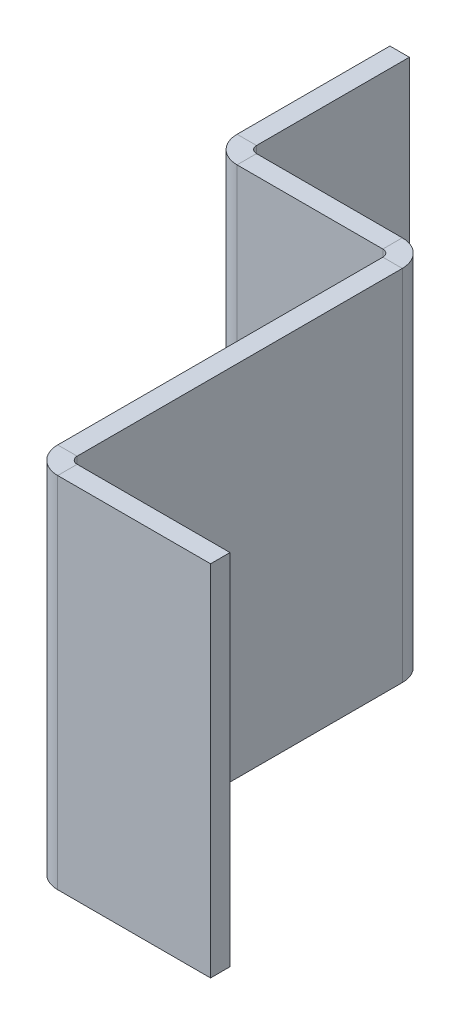
ISO-10303-21;
HEADER;
FILE_DESCRIPTION(('STEP AP214'),'2;1');
FILE_NAME('part.step','',(''),(''),'','','');
FILE_SCHEMA(('AUTOMOTIVE_DESIGN { 1 0 10303 214 1 1 1 1 }'));
ENDSEC;
DATA;
#1=APPLICATION_CONTEXT('core data for automotive mechanical design processes');
#2=APPLICATION_PROTOCOL_DEFINITION('international standard','automotive_design',2000,#1);
#3=PRODUCT_CONTEXT('',#1,'mechanical');
#4=PRODUCT('Part','Part','',(#3));
#5=PRODUCT_RELATED_PRODUCT_CATEGORY('part','',(#4));
#6=PRODUCT_DEFINITION_FORMATION('','',#4);
#7=PRODUCT_DEFINITION_CONTEXT('part definition',#1,'design');
#8=PRODUCT_DEFINITION('design','',#6,#7);
#9=PRODUCT_DEFINITION_SHAPE('','',#8);
#10=(LENGTH_UNIT() NAMED_UNIT(*) SI_UNIT(.MILLI.,.METRE.));
#11=(NAMED_UNIT(*) PLANE_ANGLE_UNIT() SI_UNIT($,.RADIAN.));
#12=(NAMED_UNIT(*) SI_UNIT($,.STERADIAN.) SOLID_ANGLE_UNIT());
#13=UNCERTAINTY_MEASURE_WITH_UNIT(LENGTH_MEASURE(1.E-05),#10,'distance_accuracy_value','');
#14=(GEOMETRIC_REPRESENTATION_CONTEXT(3) GLOBAL_UNCERTAINTY_ASSIGNED_CONTEXT((#13)) GLOBAL_UNIT_ASSIGNED_CONTEXT((#10,
#11,#12)) REPRESENTATION_CONTEXT('',''));
#15=CARTESIAN_POINT('',(0.,0.,0.));
#16=DIRECTION('',(0.,0.,1.));
#17=DIRECTION('',(1.,0.,0.));
#18=AXIS2_PLACEMENT_3D('',#15,#16,#17);
#19=CARTESIAN_POINT('',(15.45336,0.,22.64664));
#20=DIRECTION('',(0.,1.,0.));
#21=DIRECTION('',(0.,0.,-1.));
#22=AXIS2_PLACEMENT_3D('',#19,#20,#21);
#23=PLANE('',#22);
#24=DIRECTION('',(1.,0.,0.));
#25=VECTOR('',#24,1.);
#26=CARTESIAN_POINT('',(15.45336,0.,21.64664));
#27=LINE('',#26,#25);
#28=CARTESIAN_POINT('',(12.7,0.,21.64664));
#29=VERTEX_POINT('',#28);
#30=CARTESIAN_POINT('',(15.45336,0.,21.64664));
#31=VERTEX_POINT('',#30);
#32=EDGE_CURVE('E11',#29,#31,#27,.T.);
#33=ORIENTED_EDGE('',*,*,#32,.F.);
#34=DIRECTION('',(0.,0.,1.));
#35=VECTOR('',#34,1.);
#36=CARTESIAN_POINT('',(12.7,0.,22.64664));
#37=LINE('',#36,#35);
#38=CARTESIAN_POINT('',(12.7,0.,-24.4));
#39=VERTEX_POINT('',#38);
#40=EDGE_CURVE('E120',#29,#39,#37,.F.);
#41=ORIENTED_EDGE('',*,*,#40,.T.);
#42=DIRECTION('',(1.,0.,0.));
#43=VECTOR('',#42,1.);
#44=CARTESIAN_POINT('',(15.45336,0.,-24.4));
#45=LINE('',#44,#43);
#46=CARTESIAN_POINT('',(15.45336,0.,-24.4));
#47=VERTEX_POINT('',#46);
#48=EDGE_CURVE('E56',#39,#47,#45,.T.);
#49=ORIENTED_EDGE('',*,*,#48,.T.);
#50=DIRECTION('',(0.,0.,-1.));
#51=VECTOR('',#50,1.);
#52=CARTESIAN_POINT('',(15.45336,0.,22.64664));
#53=LINE('',#52,#51);
#54=EDGE_CURVE('E123',#31,#47,#53,.T.);
#55=ORIENTED_EDGE('',*,*,#54,.F.);
#56=EDGE_LOOP('',(#33,#41,#49,#55));
#57=FACE_BOUND('',#56,.T.);
#58=ADVANCED_FACE('F45',(#57),#23,.F.);
#59=CARTESIAN_POINT('',(11.7,0.,-24.4));
#60=DIRECTION('',(0.,1.,0.));
#61=DIRECTION('',(0.,0.,1.));
#62=AXIS2_PLACEMENT_3D('',#59,#60,#61);
#63=PLANE('',#62);
#64=ORIENTED_EDGE('',*,*,#48,.F.);
#65=CARTESIAN_POINT('',(11.7,0.,-24.4));
#66=DIRECTION('',(0.,-1.,0.));
#67=DIRECTION('',(0.,0.,-1.));
#68=AXIS2_PLACEMENT_3D('',#65,#66,#67);
#69=CIRCLE('',#68,1.);
#70=CARTESIAN_POINT('',(11.7,0.,-25.4));
#71=VERTEX_POINT('',#70);
#72=EDGE_CURVE('E167',#39,#71,#69,.F.);
#73=ORIENTED_EDGE('',*,*,#72,.T.);
#74=DIRECTION('',(0.,0.,-1.));
#75=VECTOR('',#74,1.);
#76=CARTESIAN_POINT('',(11.7,0.,-28.15336));
#77=LINE('',#76,#75);
#78=CARTESIAN_POINT('',(11.7,0.,-28.15336));
#79=VERTEX_POINT('',#78);
#80=EDGE_CURVE('E216',#71,#79,#77,.T.);
#81=ORIENTED_EDGE('',*,*,#80,.T.);
#82=CARTESIAN_POINT('',(11.7,0.,-24.4));
#83=DIRECTION('',(0.,-1.,0.));
#84=DIRECTION('',(0.,0.,-1.));
#85=AXIS2_PLACEMENT_3D('',#82,#83,#84);
#86=CIRCLE('',#85,3.75336);
#87=EDGE_CURVE('E241',#47,#79,#86,.F.);
#88=ORIENTED_EDGE('',*,*,#87,.F.);
#89=EDGE_LOOP('',(#64,#73,#81,#88));
#90=FACE_BOUND('',#89,.T.);
#91=ADVANCED_FACE('F242',(#90),#63,.F.);
#92=CARTESIAN_POINT('',(-9.94664,0.,-28.15336));
#93=DIRECTION('',(0.,1.,0.));
#94=DIRECTION('',(-1.,0.,0.));
#95=AXIS2_PLACEMENT_3D('',#92,#93,#94);
#96=PLANE('',#95);
#97=ORIENTED_EDGE('',*,*,#80,.F.);
#98=DIRECTION('',(1.,0.,0.));
#99=VECTOR('',#98,1.);
#100=CARTESIAN_POINT('',(-9.94664,0.,-25.4));
#101=LINE('',#100,#99);
#102=CARTESIAN_POINT('',(-8.94664,0.,-25.4));
#103=VERTEX_POINT('',#102);
#104=EDGE_CURVE('E164',#71,#103,#101,.F.);
#105=ORIENTED_EDGE('',*,*,#104,.T.);
#106=DIRECTION('',(0.,0.,-1.));
#107=VECTOR('',#106,1.);
#108=CARTESIAN_POINT('',(-8.94664,0.,-28.15336));
#109=LINE('',#108,#107);
#110=CARTESIAN_POINT('',(-8.94664,0.,-28.15336));
#111=VERTEX_POINT('',#110);
#112=EDGE_CURVE('E64',#103,#111,#109,.T.);
#113=ORIENTED_EDGE('',*,*,#112,.T.);
#114=DIRECTION('',(-1.,0.,0.));
#115=VECTOR('',#114,1.);
#116=CARTESIAN_POINT('',(-9.94664,0.,-28.15336));
#117=LINE('',#116,#115);
#118=EDGE_CURVE('E345',#79,#111,#117,.T.);
#119=ORIENTED_EDGE('',*,*,#118,.F.);
#120=EDGE_LOOP('',(#97,#105,#113,#119));
#121=FACE_BOUND('',#120,.T.);
#122=ADVANCED_FACE('F344',(#121),#96,.F.);
#123=CARTESIAN_POINT('',(-8.94664,0.,-29.15336));
#124=DIRECTION('',(0.,-1.,0.));
#125=DIRECTION('',(0.,0.,-1.));
#126=AXIS2_PLACEMENT_3D('',#123,#124,#125);
#127=PLANE('',#126);
#128=ORIENTED_EDGE('',*,*,#112,.F.);
#129=CARTESIAN_POINT('',(-8.94664,0.,-29.15336));
#130=DIRECTION('',(0.,1.,0.));
#131=DIRECTION('',(0.,0.,1.));
#132=AXIS2_PLACEMENT_3D('',#129,#130,#131);
#133=CIRCLE('',#132,3.75336);
#134=CARTESIAN_POINT('',(-12.7,0.,-29.15336));
#135=VERTEX_POINT('',#134);
#136=EDGE_CURVE('E318',#103,#135,#133,.F.);
#137=ORIENTED_EDGE('',*,*,#136,.T.);
#138=DIRECTION('',(1.,0.,0.));
#139=VECTOR('',#138,1.);
#140=CARTESIAN_POINT('',(-9.94664,0.,-29.15336));
#141=LINE('',#140,#139);
#142=CARTESIAN_POINT('',(-9.94664,0.,-29.15336));
#143=VERTEX_POINT('',#142);
#144=EDGE_CURVE('E210',#135,#143,#141,.T.);
#145=ORIENTED_EDGE('',*,*,#144,.T.);
#146=CARTESIAN_POINT('',(-8.94664,0.,-29.15336));
#147=DIRECTION('',(0.,1.,0.));
#148=DIRECTION('',(0.,0.,1.));
#149=AXIS2_PLACEMENT_3D('',#146,#147,#148);
#150=CIRCLE('',#149,1.);
#151=EDGE_CURVE('E274',#111,#143,#150,.F.);
#152=ORIENTED_EDGE('',*,*,#151,.F.);
#153=EDGE_LOOP('',(#128,#137,#145,#152));
#154=FACE_BOUND('',#153,.T.);
#155=ADVANCED_FACE('F473',(#154),#127,.T.);
#156=CARTESIAN_POINT('',(-9.94664,0.,-28.15336));
#157=DIRECTION('',(0.,1.,0.));
#158=DIRECTION('',(0.,0.,-1.));
#159=AXIS2_PLACEMENT_3D('',#156,#157,#158);
#160=PLANE('',#159);
#161=ORIENTED_EDGE('',*,*,#144,.F.);
#162=DIRECTION('',(0.,0.,1.));
#163=VECTOR('',#162,1.);
#164=CARTESIAN_POINT('',(-12.7,0.,-28.15336));
#165=LINE('',#164,#163);
#166=CARTESIAN_POINT('',(-12.7,0.,-50.8));
#167=VERTEX_POINT('',#166);
#168=EDGE_CURVE('E309',#135,#167,#165,.F.);
#169=ORIENTED_EDGE('',*,*,#168,.T.);
#170=DIRECTION('',(1.,0.,0.));
#171=VECTOR('',#170,1.);
#172=CARTESIAN_POINT('',(-9.94664,0.,-50.8));
#173=LINE('',#172,#171);
#174=CARTESIAN_POINT('',(-9.94664,0.,-50.8));
#175=VERTEX_POINT('',#174);
#176=EDGE_CURVE('E206',#167,#175,#173,.T.);
#177=ORIENTED_EDGE('',*,*,#176,.T.);
#178=DIRECTION('',(0.,0.,-1.));
#179=VECTOR('',#178,1.);
#180=CARTESIAN_POINT('',(-9.94664,0.,-28.15336));
#181=LINE('',#180,#179);
#182=EDGE_CURVE('E389',#143,#175,#181,.T.);
#183=ORIENTED_EDGE('',*,*,#182,.F.);
#184=EDGE_LOOP('',(#161,#169,#177,#183));
#185=FACE_BOUND('',#184,.T.);
#186=ADVANCED_FACE('F390',(#185),#160,.F.);
#187=CARTESIAN_POINT('',(-9.94664,50.8,-50.8));
#188=DIRECTION('',(0.,0.,-1.));
#189=DIRECTION('',(0.,-1.,0.));
#190=AXIS2_PLACEMENT_3D('',#187,#188,#189);
#191=PLANE('',#190);
#192=ORIENTED_EDGE('',*,*,#176,.F.);
#193=DIRECTION('',(0.,1.,0.));
#194=VECTOR('',#193,1.);
#195=CARTESIAN_POINT('',(-12.7,50.8,-50.8));
#196=LINE('',#195,#194);
#197=CARTESIAN_POINT('',(-12.7,50.8,-50.8));
#198=VERTEX_POINT('',#197);
#199=EDGE_CURVE('E322',#198,#167,#196,.F.);
#200=ORIENTED_EDGE('',*,*,#199,.F.);
#201=DIRECTION('',(1.,0.,0.));
#202=VECTOR('',#201,1.);
#203=CARTESIAN_POINT('',(-9.94664,50.8,-50.8));
#204=LINE('',#203,#202);
#205=CARTESIAN_POINT('',(-9.94664,50.8,-50.8));
#206=VERTEX_POINT('',#205);
#207=EDGE_CURVE('E202',#198,#206,#204,.T.);
#208=ORIENTED_EDGE('',*,*,#207,.T.);
#209=DIRECTION('',(0.,-1.,0.));
#210=VECTOR('',#209,1.);
#211=CARTESIAN_POINT('',(-9.94664,50.8,-50.8));
#212=LINE('',#211,#210);
#213=EDGE_CURVE('E378',#206,#175,#212,.T.);
#214=ORIENTED_EDGE('',*,*,#213,.T.);
#215=EDGE_LOOP('',(#192,#200,#208,#214));
#216=FACE_BOUND('',#215,.T.);
#217=ADVANCED_FACE('F444',(#216),#191,.T.);
#218=CARTESIAN_POINT('',(-9.94664,50.8,-28.15336));
#219=DIRECTION('',(0.,1.,0.));
#220=DIRECTION('',(0.,0.,-1.));
#221=AXIS2_PLACEMENT_3D('',#218,#219,#220);
#222=PLANE('',#221);
#223=ORIENTED_EDGE('',*,*,#207,.F.);
#224=DIRECTION('',(0.,0.,1.));
#225=VECTOR('',#224,1.);
#226=CARTESIAN_POINT('',(-12.7,50.8,-28.15336));
#227=LINE('',#226,#225);
#228=CARTESIAN_POINT('',(-12.7,50.8,-29.15336));
#229=VERTEX_POINT('',#228);
#230=EDGE_CURVE('E301',#229,#198,#227,.F.);
#231=ORIENTED_EDGE('',*,*,#230,.F.);
#232=DIRECTION('',(1.,0.,0.));
#233=VECTOR('',#232,1.);
#234=CARTESIAN_POINT('',(-9.94664,50.8,-29.15336));
#235=LINE('',#234,#233);
#236=CARTESIAN_POINT('',(-9.94664,50.8,-29.15336));
#237=VERTEX_POINT('',#236);
#238=EDGE_CURVE('E198',#229,#237,#235,.T.);
#239=ORIENTED_EDGE('',*,*,#238,.T.);
#240=DIRECTION('',(0.,0.,-1.));
#241=VECTOR('',#240,1.);
#242=CARTESIAN_POINT('',(-9.94664,50.8,-28.15336));
#243=LINE('',#242,#241);
#244=EDGE_CURVE('E368',#237,#206,#243,.T.);
#245=ORIENTED_EDGE('',*,*,#244,.T.);
#246=EDGE_LOOP('',(#223,#231,#239,#245));
#247=FACE_BOUND('',#246,.T.);
#248=ADVANCED_FACE('F366',(#247),#222,.T.);
#249=CARTESIAN_POINT('',(-8.94664,50.8,-29.15336));
#250=DIRECTION('',(0.,1.,0.));
#251=DIRECTION('',(0.,0.,1.));
#252=AXIS2_PLACEMENT_3D('',#249,#250,#251);
#253=PLANE('',#252);
#254=ORIENTED_EDGE('',*,*,#238,.F.);
#255=CARTESIAN_POINT('',(-8.94664,50.8,-29.15336));
#256=DIRECTION('',(0.,1.,0.));
#257=DIRECTION('',(0.,0.,1.));
#258=AXIS2_PLACEMENT_3D('',#255,#256,#257);
#259=CIRCLE('',#258,3.75336);
#260=CARTESIAN_POINT('',(-8.94664,50.8,-25.4));
#261=VERTEX_POINT('',#260);
#262=EDGE_CURVE('E314',#229,#261,#259,.T.);
#263=ORIENTED_EDGE('',*,*,#262,.T.);
#264=DIRECTION('',(0.,0.,-1.));
#265=VECTOR('',#264,1.);
#266=CARTESIAN_POINT('',(-8.94664,50.8,-28.15336));
#267=LINE('',#266,#265);
#268=CARTESIAN_POINT('',(-8.94664,50.8,-28.15336));
#269=VERTEX_POINT('',#268);
#270=EDGE_CURVE('E195',#261,#269,#267,.T.);
#271=ORIENTED_EDGE('',*,*,#270,.T.);
#272=CARTESIAN_POINT('',(-8.94664,50.8,-29.15336));
#273=DIRECTION('',(0.,-1.,0.));
#274=DIRECTION('',(0.,0.,-1.));
#275=AXIS2_PLACEMENT_3D('',#272,#273,#274);
#276=CIRCLE('',#275,1.);
#277=EDGE_CURVE('E248',#237,#269,#276,.F.);
#278=ORIENTED_EDGE('',*,*,#277,.F.);
#279=EDGE_LOOP('',(#254,#263,#271,#278));
#280=FACE_BOUND('',#279,.T.);
#281=ADVANCED_FACE('F382',(#280),#253,.T.);
#282=CARTESIAN_POINT('',(-9.94664,50.8,-28.15336));
#283=DIRECTION('',(0.,1.,0.));
#284=DIRECTION('',(-1.,0.,0.));
#285=AXIS2_PLACEMENT_3D('',#282,#283,#284);
#286=PLANE('',#285);
#287=ORIENTED_EDGE('',*,*,#270,.F.);
#288=DIRECTION('',(1.,0.,0.));
#289=VECTOR('',#288,1.);
#290=CARTESIAN_POINT('',(-9.94664,50.8,-25.4));
#291=LINE('',#290,#289);
#292=CARTESIAN_POINT('',(11.7,50.8,-25.4));
#293=VERTEX_POINT('',#292);
#294=EDGE_CURVE('E154',#293,#261,#291,.F.);
#295=ORIENTED_EDGE('',*,*,#294,.F.);
#296=DIRECTION('',(0.,0.,-1.));
#297=VECTOR('',#296,1.);
#298=CARTESIAN_POINT('',(11.7,50.8,-28.15336));
#299=LINE('',#298,#297);
#300=CARTESIAN_POINT('',(11.7,50.8,-28.15336));
#301=VERTEX_POINT('',#300);
#302=EDGE_CURVE('E191',#293,#301,#299,.T.);
#303=ORIENTED_EDGE('',*,*,#302,.T.);
#304=DIRECTION('',(-1.,0.,0.));
#305=VECTOR('',#304,1.);
#306=CARTESIAN_POINT('',(-9.94664,50.8,-28.15336));
#307=LINE('',#306,#305);
#308=EDGE_CURVE('E238',#301,#269,#307,.T.);
#309=ORIENTED_EDGE('',*,*,#308,.T.);
#310=EDGE_LOOP('',(#287,#295,#303,#309));
#311=FACE_BOUND('',#310,.T.);
#312=ADVANCED_FACE('F451',(#311),#286,.T.);
#313=CARTESIAN_POINT('',(11.7,50.8,-24.4));
#314=DIRECTION('',(0.,-1.,0.));
#315=DIRECTION('',(0.,0.,-1.));
#316=AXIS2_PLACEMENT_3D('',#313,#314,#315);
#317=PLANE('',#316);
#318=ORIENTED_EDGE('',*,*,#302,.F.);
#319=CARTESIAN_POINT('',(11.7,50.8,-24.4));
#320=DIRECTION('',(0.,-1.,0.));
#321=DIRECTION('',(0.,0.,-1.));
#322=AXIS2_PLACEMENT_3D('',#319,#320,#321);
#323=CIRCLE('',#322,1.);
#324=CARTESIAN_POINT('',(12.7,50.8,-24.4));
#325=VERTEX_POINT('',#324);
#326=EDGE_CURVE('E160',#293,#325,#323,.T.);
#327=ORIENTED_EDGE('',*,*,#326,.T.);
#328=DIRECTION('',(1.,0.,0.));
#329=VECTOR('',#328,1.);
#330=CARTESIAN_POINT('',(15.45336,50.8,-24.4));
#331=LINE('',#330,#329);
#332=CARTESIAN_POINT('',(15.45336,50.8,-24.4));
#333=VERTEX_POINT('',#332);
#334=EDGE_CURVE('E187',#325,#333,#331,.T.);
#335=ORIENTED_EDGE('',*,*,#334,.T.);
#336=CARTESIAN_POINT('',(11.7,50.8,-24.4));
#337=DIRECTION('',(0.,1.,0.));
#338=DIRECTION('',(0.,0.,1.));
#339=AXIS2_PLACEMENT_3D('',#336,#337,#338);
#340=CIRCLE('',#339,3.75336);
#341=EDGE_CURVE('E247',#301,#333,#340,.F.);
#342=ORIENTED_EDGE('',*,*,#341,.F.);
#343=EDGE_LOOP('',(#318,#327,#335,#342));
#344=FACE_BOUND('',#343,.T.);
#345=ADVANCED_FACE('F455',(#344),#317,.F.);
#346=CARTESIAN_POINT('',(15.45336,50.8,22.64664));
#347=DIRECTION('',(0.,1.,0.));
#348=DIRECTION('',(0.,0.,-1.));
#349=AXIS2_PLACEMENT_3D('',#346,#347,#348);
#350=PLANE('',#349);
#351=ORIENTED_EDGE('',*,*,#334,.F.);
#352=DIRECTION('',(0.,0.,1.));
#353=VECTOR('',#352,1.);
#354=CARTESIAN_POINT('',(12.7,50.8,22.64664));
#355=LINE('',#354,#353);
#356=CARTESIAN_POINT('',(12.7,50.8,21.64664));
#357=VERTEX_POINT('',#356);
#358=EDGE_CURVE('E153',#357,#325,#355,.F.);
#359=ORIENTED_EDGE('',*,*,#358,.F.);
#360=DIRECTION('',(1.,0.,0.));
#361=VECTOR('',#360,1.);
#362=CARTESIAN_POINT('',(15.45336,50.8,21.64664));
#363=LINE('',#362,#361);
#364=CARTESIAN_POINT('',(15.45336,50.8,21.64664));
#365=VERTEX_POINT('',#364);
#366=EDGE_CURVE('E183',#357,#365,#363,.T.);
#367=ORIENTED_EDGE('',*,*,#366,.T.);
#368=DIRECTION('',(0.,0.,-1.));
#369=VECTOR('',#368,1.);
#370=CARTESIAN_POINT('',(15.45336,50.8,22.64664));
#371=LINE('',#370,#369);
#372=EDGE_CURVE('E237',#365,#333,#371,.T.);
#373=ORIENTED_EDGE('',*,*,#372,.T.);
#374=EDGE_LOOP('',(#351,#359,#367,#373));
#375=FACE_BOUND('',#374,.T.);
#376=ADVANCED_FACE('F461',(#375),#350,.T.);
#377=CARTESIAN_POINT('',(16.45336,50.8,21.64664));
#378=DIRECTION('',(0.,1.,0.));
#379=DIRECTION('',(0.,0.,1.));
#380=AXIS2_PLACEMENT_3D('',#377,#378,#379);
#381=PLANE('',#380);
#382=ORIENTED_EDGE('',*,*,#366,.F.);
#383=CARTESIAN_POINT('',(16.45336,50.8,21.64664));
#384=DIRECTION('',(0.,1.,0.));
#385=DIRECTION('',(0.,0.,1.));
#386=AXIS2_PLACEMENT_3D('',#383,#384,#385);
#387=CIRCLE('',#386,3.75336);
#388=CARTESIAN_POINT('',(16.45336,50.8,25.4));
#389=VERTEX_POINT('',#388);
#390=EDGE_CURVE('E139',#357,#389,#387,.T.);
#391=ORIENTED_EDGE('',*,*,#390,.T.);
#392=DIRECTION('',(0.,0.,-1.));
#393=VECTOR('',#392,1.);
#394=CARTESIAN_POINT('',(16.45336,50.8,22.64664));
#395=LINE('',#394,#393);
#396=CARTESIAN_POINT('',(16.45336,50.8,22.64664));
#397=VERTEX_POINT('',#396);
#398=EDGE_CURVE('E179',#389,#397,#395,.T.);
#399=ORIENTED_EDGE('',*,*,#398,.T.);
#400=CARTESIAN_POINT('',(16.45336,50.8,21.64664));
#401=DIRECTION('',(0.,-1.,0.));
#402=DIRECTION('',(0.,0.,-1.));
#403=AXIS2_PLACEMENT_3D('',#400,#401,#402);
#404=CIRCLE('',#403,1.);
#405=EDGE_CURVE('E352',#365,#397,#404,.F.);
#406=ORIENTED_EDGE('',*,*,#405,.F.);
#407=EDGE_LOOP('',(#382,#391,#399,#406));
#408=FACE_BOUND('',#407,.T.);
#409=ADVANCED_FACE('F511',(#408),#381,.T.);
#410=CARTESIAN_POINT('',(15.45336,50.8,22.64664));
#411=DIRECTION('',(0.,1.,0.));
#412=DIRECTION('',(-1.,0.,0.));
#413=AXIS2_PLACEMENT_3D('',#410,#411,#412);
#414=PLANE('',#413);
#415=ORIENTED_EDGE('',*,*,#398,.F.);
#416=DIRECTION('',(1.,0.,0.));
#417=VECTOR('',#416,1.);
#418=CARTESIAN_POINT('',(15.45336,50.8,25.4));
#419=LINE('',#418,#417);
#420=CARTESIAN_POINT('',(38.1,50.8,25.4));
#421=VERTEX_POINT('',#420);
#422=EDGE_CURVE('E300',#421,#389,#419,.F.);
#423=ORIENTED_EDGE('',*,*,#422,.F.);
#424=DIRECTION('',(0.,0.,-1.));
#425=VECTOR('',#424,1.);
#426=CARTESIAN_POINT('',(38.1,50.8,22.64664));
#427=LINE('',#426,#425);
#428=CARTESIAN_POINT('',(38.1,50.8,22.64664));
#429=VERTEX_POINT('',#428);
#430=EDGE_CURVE('E175',#421,#429,#427,.T.);
#431=ORIENTED_EDGE('',*,*,#430,.T.);
#432=DIRECTION('',(-1.,0.,0.));
#433=VECTOR('',#432,1.);
#434=CARTESIAN_POINT('',(15.45336,50.8,22.64664));
#435=LINE('',#434,#433);
#436=EDGE_CURVE('E401',#429,#397,#435,.T.);
#437=ORIENTED_EDGE('',*,*,#436,.T.);
#438=EDGE_LOOP('',(#415,#423,#431,#437));
#439=FACE_BOUND('',#438,.T.);
#440=ADVANCED_FACE('F426',(#439),#414,.T.);
#441=CARTESIAN_POINT('',(38.1,50.8,22.64664));
#442=DIRECTION('',(-1.,0.,0.));
#443=DIRECTION('',(0.,-1.,0.));
#444=AXIS2_PLACEMENT_3D('',#441,#442,#443);
#445=PLANE('',#444);
#446=ORIENTED_EDGE('',*,*,#430,.F.);
#447=DIRECTION('',(0.,1.,0.));
#448=VECTOR('',#447,1.);
#449=CARTESIAN_POINT('',(38.1,50.8,25.4));
#450=LINE('',#449,#448);
#451=CARTESIAN_POINT('',(38.1,0.,25.4));
#452=VERTEX_POINT('',#451);
#453=EDGE_CURVE('E145',#421,#452,#450,.F.);
#454=ORIENTED_EDGE('',*,*,#453,.T.);
#455=DIRECTION('',(0.,0.,-1.));
#456=VECTOR('',#455,1.);
#457=CARTESIAN_POINT('',(38.1,0.,22.64664));
#458=LINE('',#457,#456);
#459=CARTESIAN_POINT('',(38.1,0.,22.64664));
#460=VERTEX_POINT('',#459);
#461=EDGE_CURVE('E171',#452,#460,#458,.T.);
#462=ORIENTED_EDGE('',*,*,#461,.T.);
#463=DIRECTION('',(0.,-1.,0.));
#464=VECTOR('',#463,1.);
#465=CARTESIAN_POINT('',(38.1,50.8,22.64664));
#466=LINE('',#465,#464);
#467=EDGE_CURVE('E405',#429,#460,#466,.T.);
#468=ORIENTED_EDGE('',*,*,#467,.F.);
#469=EDGE_LOOP('',(#446,#454,#462,#468));
#470=FACE_BOUND('',#469,.T.);
#471=ADVANCED_FACE('F531',(#470),#445,.F.);
#472=CARTESIAN_POINT('',(15.45336,0.,22.64664));
#473=DIRECTION('',(0.,1.,0.));
#474=DIRECTION('',(-1.,0.,0.));
#475=AXIS2_PLACEMENT_3D('',#472,#473,#474);
#476=PLANE('',#475);
#477=ORIENTED_EDGE('',*,*,#461,.F.);
#478=DIRECTION('',(1.,0.,0.));
#479=VECTOR('',#478,1.);
#480=CARTESIAN_POINT('',(15.45336,0.,25.4));
#481=LINE('',#480,#479);
#482=CARTESIAN_POINT('',(16.45336,0.,25.4));
#483=VERTEX_POINT('',#482);
#484=EDGE_CURVE('E297',#452,#483,#481,.F.);
#485=ORIENTED_EDGE('',*,*,#484,.T.);
#486=DIRECTION('',(0.,0.,-1.));
#487=VECTOR('',#486,1.);
#488=CARTESIAN_POINT('',(16.45336,0.,22.64664));
#489=LINE('',#488,#487);
#490=CARTESIAN_POINT('',(16.45336,0.,22.64664));
#491=VERTEX_POINT('',#490);
#492=EDGE_CURVE('E49',#483,#491,#489,.T.);
#493=ORIENTED_EDGE('',*,*,#492,.T.);
#494=DIRECTION('',(-1.,0.,0.));
#495=VECTOR('',#494,1.);
#496=CARTESIAN_POINT('',(15.45336,0.,22.64664));
#497=LINE('',#496,#495);
#498=EDGE_CURVE('E380',#460,#491,#497,.T.);
#499=ORIENTED_EDGE('',*,*,#498,.F.);
#500=EDGE_LOOP('',(#477,#485,#493,#499));
#501=FACE_BOUND('',#500,.T.);
#502=ADVANCED_FACE('F541',(#501),#476,.F.);
#503=CARTESIAN_POINT('',(16.45336,0.,21.64664));
#504=DIRECTION('',(0.,-1.,0.));
#505=DIRECTION('',(0.,0.,-1.));
#506=AXIS2_PLACEMENT_3D('',#503,#504,#505);
#507=PLANE('',#506);
#508=CARTESIAN_POINT('',(16.45336,0.,21.64664));
#509=DIRECTION('',(0.,1.,0.));
#510=DIRECTION('',(0.,0.,1.));
#511=AXIS2_PLACEMENT_3D('',#508,#509,#510);
#512=CIRCLE('',#511,3.75336);
#513=EDGE_CURVE('E136',#483,#29,#512,.F.);
#514=ORIENTED_EDGE('',*,*,#513,.T.);
#515=ORIENTED_EDGE('',*,*,#32,.T.);
#516=CARTESIAN_POINT('',(16.45336,0.,21.64664));
#517=DIRECTION('',(0.,1.,0.));
#518=DIRECTION('',(0.,0.,1.));
#519=AXIS2_PLACEMENT_3D('',#516,#517,#518);
#520=CIRCLE('',#519,1.);
#521=EDGE_CURVE('E269',#491,#31,#520,.F.);
#522=ORIENTED_EDGE('',*,*,#521,.F.);
#523=ORIENTED_EDGE('',*,*,#492,.F.);
#524=EDGE_LOOP('',(#514,#515,#522,#523));
#525=FACE_BOUND('',#524,.T.);
#526=ADVANCED_FACE('F47',(#525),#507,.T.);
#527=CARTESIAN_POINT('',(15.45336,50.8,22.64664));
#528=DIRECTION('',(0.,0.,1.));
#529=DIRECTION('',(1.,0.,0.));
#530=AXIS2_PLACEMENT_3D('',#527,#528,#529);
#531=PLANE('',#530);
#532=ORIENTED_EDGE('',*,*,#498,.T.);
#533=DIRECTION('',(0.,-1.,0.));
#534=VECTOR('',#533,1.);
#535=CARTESIAN_POINT('',(16.45336,50.8,22.64664));
#536=LINE('',#535,#534);
#537=EDGE_CURVE('E264',#491,#397,#536,.F.);
#538=ORIENTED_EDGE('',*,*,#537,.T.);
#539=ORIENTED_EDGE('',*,*,#436,.F.);
#540=ORIENTED_EDGE('',*,*,#467,.T.);
#541=EDGE_LOOP('',(#532,#538,#539,#540));
#542=FACE_BOUND('',#541,.T.);
#543=ADVANCED_FACE('F431',(#542),#531,.F.);
#544=CARTESIAN_POINT('',(-9.94664,50.8,-28.15336));
#545=DIRECTION('',(-1.,0.,0.));
#546=DIRECTION('',(0.,0.,1.));
#547=AXIS2_PLACEMENT_3D('',#544,#545,#546);
#548=PLANE('',#547);
#549=ORIENTED_EDGE('',*,*,#244,.F.);
#550=DIRECTION('',(0.,-1.,0.));
#551=VECTOR('',#550,1.);
#552=CARTESIAN_POINT('',(-9.94664,0.,-29.15336));
#553=LINE('',#552,#551);
#554=EDGE_CURVE('E255',#237,#143,#553,.T.);
#555=ORIENTED_EDGE('',*,*,#554,.T.);
#556=ORIENTED_EDGE('',*,*,#182,.T.);
#557=ORIENTED_EDGE('',*,*,#213,.F.);
#558=EDGE_LOOP('',(#549,#555,#556,#557));
#559=FACE_BOUND('',#558,.T.);
#560=ADVANCED_FACE('F374',(#559),#548,.F.);
#561=CARTESIAN_POINT('',(15.45336,50.8,22.64664));
#562=DIRECTION('',(-1.,0.,0.));
#563=DIRECTION('',(0.,0.,1.));
#564=AXIS2_PLACEMENT_3D('',#561,#562,#563);
#565=PLANE('',#564);
#566=ORIENTED_EDGE('',*,*,#54,.T.);
#567=DIRECTION('',(0.,-1.,0.));
#568=VECTOR('',#567,1.);
#569=CARTESIAN_POINT('',(15.45336,50.8,-24.4));
#570=LINE('',#569,#568);
#571=EDGE_CURVE('E233',#47,#333,#570,.F.);
#572=ORIENTED_EDGE('',*,*,#571,.T.);
#573=ORIENTED_EDGE('',*,*,#372,.F.);
#574=DIRECTION('',(0.,-1.,0.));
#575=VECTOR('',#574,1.);
#576=CARTESIAN_POINT('',(15.45336,0.,21.64664));
#577=LINE('',#576,#575);
#578=EDGE_CURVE('E235',#365,#31,#577,.T.);
#579=ORIENTED_EDGE('',*,*,#578,.T.);
#580=EDGE_LOOP('',(#566,#572,#573,#579));
#581=FACE_BOUND('',#580,.T.);
#582=ADVANCED_FACE('F230',(#581),#565,.F.);
#583=CARTESIAN_POINT('',(-9.94664,50.8,-28.15336));
#584=DIRECTION('',(0.,0.,1.));
#585=DIRECTION('',(1.,0.,0.));
#586=AXIS2_PLACEMENT_3D('',#583,#584,#585);
#587=PLANE('',#586);
#588=ORIENTED_EDGE('',*,*,#118,.T.);
#589=DIRECTION('',(0.,-1.,0.));
#590=VECTOR('',#589,1.);
#591=CARTESIAN_POINT('',(-8.94664,50.8,-28.15336));
#592=LINE('',#591,#590);
#593=EDGE_CURVE('E261',#111,#269,#592,.F.);
#594=ORIENTED_EDGE('',*,*,#593,.T.);
#595=ORIENTED_EDGE('',*,*,#308,.F.);
#596=DIRECTION('',(0.,-1.,0.));
#597=VECTOR('',#596,1.);
#598=CARTESIAN_POINT('',(11.7,50.8,-28.15336));
#599=LINE('',#598,#597);
#600=EDGE_CURVE('E256',#301,#79,#599,.T.);
#601=ORIENTED_EDGE('',*,*,#600,.T.);
#602=EDGE_LOOP('',(#588,#594,#595,#601));
#603=FACE_BOUND('',#602,.T.);
#604=ADVANCED_FACE('F355',(#603),#587,.F.);
#605=CARTESIAN_POINT('',(16.45336,50.8,21.64664));
#606=DIRECTION('',(0.,1.,0.));
#607=DIRECTION('',(0.,0.,1.));
#608=AXIS2_PLACEMENT_3D('',#605,#606,#607);
#609=CYLINDRICAL_SURFACE('',#608,1.);
#610=ORIENTED_EDGE('',*,*,#405,.T.);
#611=ORIENTED_EDGE('',*,*,#537,.F.);
#612=ORIENTED_EDGE('',*,*,#521,.T.);
#613=ORIENTED_EDGE('',*,*,#578,.F.);
#614=EDGE_LOOP('',(#610,#611,#612,#613));
#615=FACE_BOUND('',#614,.T.);
#616=ADVANCED_FACE('F420',(#615),#609,.F.);
#617=CARTESIAN_POINT('',(11.7,50.8,-24.4));
#618=DIRECTION('',(0.,-1.,0.));
#619=DIRECTION('',(0.,0.,-1.));
#620=AXIS2_PLACEMENT_3D('',#617,#618,#619);
#621=CYLINDRICAL_SURFACE('',#620,3.75336);
#622=ORIENTED_EDGE('',*,*,#341,.T.);
#623=ORIENTED_EDGE('',*,*,#571,.F.);
#624=ORIENTED_EDGE('',*,*,#87,.T.);
#625=ORIENTED_EDGE('',*,*,#600,.F.);
#626=EDGE_LOOP('',(#622,#623,#624,#625));
#627=FACE_BOUND('',#626,.T.);
#628=ADVANCED_FACE('F251',(#627),#621,.T.);
#629=CARTESIAN_POINT('',(-8.94664,50.8,-29.15336));
#630=DIRECTION('',(0.,1.,0.));
#631=DIRECTION('',(0.,0.,1.));
#632=AXIS2_PLACEMENT_3D('',#629,#630,#631);
#633=CYLINDRICAL_SURFACE('',#632,1.);
#634=ORIENTED_EDGE('',*,*,#277,.T.);
#635=ORIENTED_EDGE('',*,*,#593,.F.);
#636=ORIENTED_EDGE('',*,*,#151,.T.);
#637=ORIENTED_EDGE('',*,*,#554,.F.);
#638=EDGE_LOOP('',(#634,#635,#636,#637));
#639=FACE_BOUND('',#638,.T.);
#640=ADVANCED_FACE('F385',(#639),#633,.F.);
#641=CARTESIAN_POINT('',(15.45336,50.8,25.4));
#642=DIRECTION('',(0.,0.,1.));
#643=DIRECTION('',(1.,0.,0.));
#644=AXIS2_PLACEMENT_3D('',#641,#642,#643);
#645=PLANE('',#644);
#646=ORIENTED_EDGE('',*,*,#484,.F.);
#647=ORIENTED_EDGE('',*,*,#453,.F.);
#648=ORIENTED_EDGE('',*,*,#422,.T.);
#649=DIRECTION('',(0.,1.,0.));
#650=VECTOR('',#649,1.);
#651=CARTESIAN_POINT('',(16.45336,50.8,25.4));
#652=LINE('',#651,#650);
#653=EDGE_CURVE('E144',#483,#389,#652,.T.);
#654=ORIENTED_EDGE('',*,*,#653,.F.);
#655=EDGE_LOOP('',(#646,#647,#648,#654));
#656=FACE_BOUND('',#655,.T.);
#657=ADVANCED_FACE('F623',(#656),#645,.T.);
#658=CARTESIAN_POINT('',(-12.7,50.8,-28.15336));
#659=DIRECTION('',(-1.,0.,0.));
#660=DIRECTION('',(0.,0.,1.));
#661=AXIS2_PLACEMENT_3D('',#658,#659,#660);
#662=PLANE('',#661);
#663=ORIENTED_EDGE('',*,*,#230,.T.);
#664=ORIENTED_EDGE('',*,*,#199,.T.);
#665=ORIENTED_EDGE('',*,*,#168,.F.);
#666=DIRECTION('',(0.,1.,0.));
#667=VECTOR('',#666,1.);
#668=CARTESIAN_POINT('',(-12.7,50.8,-29.15336));
#669=LINE('',#668,#667);
#670=EDGE_CURVE('E287',#229,#135,#669,.F.);
#671=ORIENTED_EDGE('',*,*,#670,.F.);
#672=EDGE_LOOP('',(#663,#664,#665,#671));
#673=FACE_BOUND('',#672,.T.);
#674=ADVANCED_FACE('F446',(#673),#662,.T.);
#675=CARTESIAN_POINT('',(12.7,50.8,22.64664));
#676=DIRECTION('',(-1.,0.,0.));
#677=DIRECTION('',(0.,0.,1.));
#678=AXIS2_PLACEMENT_3D('',#675,#676,#677);
#679=PLANE('',#678);
#680=ORIENTED_EDGE('',*,*,#40,.F.);
#681=DIRECTION('',(0.,1.,0.));
#682=VECTOR('',#681,1.);
#683=CARTESIAN_POINT('',(12.7,50.8,21.64664));
#684=LINE('',#683,#682);
#685=EDGE_CURVE('E133',#357,#29,#684,.F.);
#686=ORIENTED_EDGE('',*,*,#685,.F.);
#687=ORIENTED_EDGE('',*,*,#358,.T.);
#688=DIRECTION('',(0.,1.,0.));
#689=VECTOR('',#688,1.);
#690=CARTESIAN_POINT('',(12.7,50.8,-24.4));
#691=LINE('',#690,#689);
#692=EDGE_CURVE('E150',#39,#325,#691,.T.);
#693=ORIENTED_EDGE('',*,*,#692,.F.);
#694=EDGE_LOOP('',(#680,#686,#687,#693));
#695=FACE_BOUND('',#694,.T.);
#696=ADVANCED_FACE('F148',(#695),#679,.T.);
#697=CARTESIAN_POINT('',(-9.94664,50.8,-25.4));
#698=DIRECTION('',(0.,0.,1.));
#699=DIRECTION('',(1.,0.,0.));
#700=AXIS2_PLACEMENT_3D('',#697,#698,#699);
#701=PLANE('',#700);
#702=ORIENTED_EDGE('',*,*,#104,.F.);
#703=DIRECTION('',(0.,1.,0.));
#704=VECTOR('',#703,1.);
#705=CARTESIAN_POINT('',(11.7,50.8,-25.4));
#706=LINE('',#705,#704);
#707=EDGE_CURVE('E283',#293,#71,#706,.F.);
#708=ORIENTED_EDGE('',*,*,#707,.F.);
#709=ORIENTED_EDGE('',*,*,#294,.T.);
#710=DIRECTION('',(0.,1.,0.));
#711=VECTOR('',#710,1.);
#712=CARTESIAN_POINT('',(-8.94664,50.8,-25.4));
#713=LINE('',#712,#711);
#714=EDGE_CURVE('E278',#103,#261,#713,.T.);
#715=ORIENTED_EDGE('',*,*,#714,.F.);
#716=EDGE_LOOP('',(#702,#708,#709,#715));
#717=FACE_BOUND('',#716,.T.);
#718=ADVANCED_FACE('F342',(#717),#701,.T.);
#719=CARTESIAN_POINT('',(16.45336,50.8,21.64664));
#720=DIRECTION('',(0.,1.,0.));
#721=DIRECTION('',(0.,0.,1.));
#722=AXIS2_PLACEMENT_3D('',#719,#720,#721);
#723=CYLINDRICAL_SURFACE('',#722,3.75336);
#724=ORIENTED_EDGE('',*,*,#390,.F.);
#725=ORIENTED_EDGE('',*,*,#685,.T.);
#726=ORIENTED_EDGE('',*,*,#513,.F.);
#727=ORIENTED_EDGE('',*,*,#653,.T.);
#728=EDGE_LOOP('',(#724,#725,#726,#727));
#729=FACE_BOUND('',#728,.T.);
#730=ADVANCED_FACE('F134',(#729),#723,.T.);
#731=CARTESIAN_POINT('',(11.7,50.8,-24.4));
#732=DIRECTION('',(0.,-1.,0.));
#733=DIRECTION('',(0.,0.,-1.));
#734=AXIS2_PLACEMENT_3D('',#731,#732,#733);
#735=CYLINDRICAL_SURFACE('',#734,1.);
#736=ORIENTED_EDGE('',*,*,#326,.F.);
#737=ORIENTED_EDGE('',*,*,#707,.T.);
#738=ORIENTED_EDGE('',*,*,#72,.F.);
#739=ORIENTED_EDGE('',*,*,#692,.T.);
#740=EDGE_LOOP('',(#736,#737,#738,#739));
#741=FACE_BOUND('',#740,.T.);
#742=ADVANCED_FACE('F336',(#741),#735,.F.);
#743=CARTESIAN_POINT('',(-8.94664,50.8,-29.15336));
#744=DIRECTION('',(0.,1.,0.));
#745=DIRECTION('',(0.,0.,1.));
#746=AXIS2_PLACEMENT_3D('',#743,#744,#745);
#747=CYLINDRICAL_SURFACE('',#746,3.75336);
#748=ORIENTED_EDGE('',*,*,#262,.F.);
#749=ORIENTED_EDGE('',*,*,#670,.T.);
#750=ORIENTED_EDGE('',*,*,#136,.F.);
#751=ORIENTED_EDGE('',*,*,#714,.T.);
#752=EDGE_LOOP('',(#748,#749,#750,#751));
#753=FACE_BOUND('',#752,.T.);
#754=ADVANCED_FACE('F450',(#753),#747,.T.);
#755=CLOSED_SHELL('',(#58,#91,#122,#155,#186,#217,#248,#281,#312,#345,#376,#409,#440,#471,#502,
#526,#543,#560,#582,#604,#616,#628,#640,#657,#674,#696,#718,#730,#742,#754));
#756=MANIFOLD_SOLID_BREP('B2',#755);
#757=ADVANCED_BREP_SHAPE_REPRESENTATION('',(#18,#756),#14);
#758=SHAPE_DEFINITION_REPRESENTATION(#9,#757);
ENDSEC;
END-ISO-10303-21;
